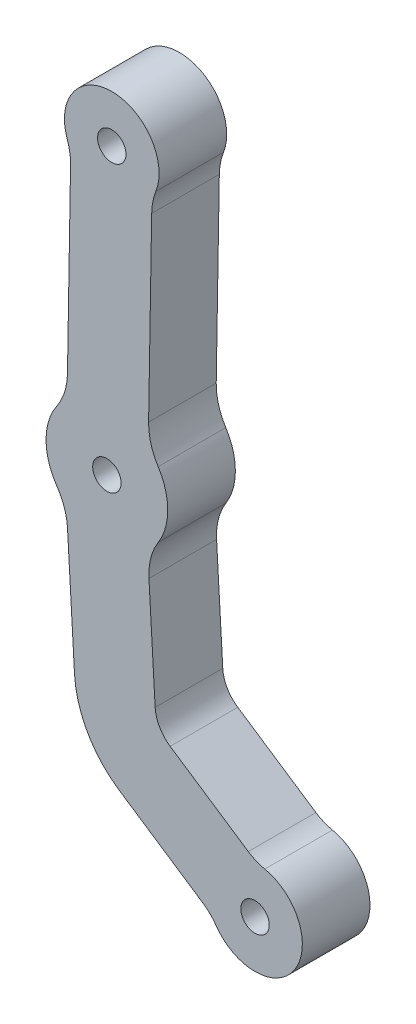
ISO-10303-21;
HEADER;
FILE_DESCRIPTION(('STEP AP214'),'2;1');
FILE_NAME('part.step','',(''),(''),'','','');
FILE_SCHEMA(('AUTOMOTIVE_DESIGN { 1 0 10303 214 1 1 1 1 }'));
ENDSEC;
DATA;
#1=APPLICATION_CONTEXT('core data for automotive mechanical design processes');
#2=APPLICATION_PROTOCOL_DEFINITION('international standard','automotive_design',2000,#1);
#3=PRODUCT_CONTEXT('',#1,'mechanical');
#4=PRODUCT('Part','Part','',(#3));
#5=PRODUCT_RELATED_PRODUCT_CATEGORY('part','',(#4));
#6=PRODUCT_DEFINITION_FORMATION('','',#4);
#7=PRODUCT_DEFINITION_CONTEXT('part definition',#1,'design');
#8=PRODUCT_DEFINITION('design','',#6,#7);
#9=PRODUCT_DEFINITION_SHAPE('','',#8);
#10=(LENGTH_UNIT() NAMED_UNIT(*) SI_UNIT(.MILLI.,.METRE.));
#11=(NAMED_UNIT(*) PLANE_ANGLE_UNIT() SI_UNIT($,.RADIAN.));
#12=(NAMED_UNIT(*) SI_UNIT($,.STERADIAN.) SOLID_ANGLE_UNIT());
#13=UNCERTAINTY_MEASURE_WITH_UNIT(LENGTH_MEASURE(1.E-05),#10,'distance_accuracy_value','');
#14=(GEOMETRIC_REPRESENTATION_CONTEXT(3) GLOBAL_UNCERTAINTY_ASSIGNED_CONTEXT((#13)) GLOBAL_UNIT_ASSIGNED_CONTEXT((#10,
#11,#12)) REPRESENTATION_CONTEXT('',''));
#15=CARTESIAN_POINT('',(0.,0.,0.));
#16=DIRECTION('',(0.,0.,1.));
#17=DIRECTION('',(1.,0.,0.));
#18=AXIS2_PLACEMENT_3D('',#15,#16,#17);
#19=CARTESIAN_POINT('',(-32.4724510234552,22.1569908736504,10.));
#20=DIRECTION('',(0.,0.,1.));
#21=DIRECTION('',(1.,0.,0.));
#22=AXIS2_PLACEMENT_3D('',#19,#20,#21);
#23=PLANE('',#22);
#24=CARTESIAN_POINT('',(-32.4724510234552,22.1569908736504,10.));
#25=DIRECTION('',(0.,0.,1.));
#26=DIRECTION('',(1.,0.,0.));
#27=AXIS2_PLACEMENT_3D('',#24,#25,#26);
#28=CIRCLE('',#27,2.1);
#29=CARTESIAN_POINT('',(-30.3724510234552,22.1569908736504,10.));
#30=VERTEX_POINT('',#29);
#31=EDGE_CURVE('E394',#30,#30,#28,.T.);
#32=ORIENTED_EDGE('',*,*,#31,.F.);
#33=EDGE_LOOP('',(#32));
#34=FACE_BOUND('',#33,.T.);
#35=CARTESIAN_POINT('',(-32.4724510234552,22.1569908736504,10.));
#36=DIRECTION('',(0.,0.,1.));
#37=DIRECTION('',(1.,0.,0.));
#38=AXIS2_PLACEMENT_3D('',#35,#36,#37);
#39=CIRCLE('',#38,8.99999999999997);
#40=CARTESIAN_POINT('',(-39.8872365006634,27.2580649102609,10.));
#41=VERTEX_POINT('',#40);
#42=CARTESIAN_POINT('',(-39.8776424322034,17.0419991630216,10.));
#43=VERTEX_POINT('',#42);
#44=EDGE_CURVE('E245',#41,#43,#39,.T.);
#45=ORIENTED_EDGE('',*,*,#44,.T.);
#46=CARTESIAN_POINT('',(-47.2828338409513,11.9270074523928,10.));
#47=DIRECTION('',(0.,0.,-1.));
#48=DIRECTION('',(1.,0.,0.));
#49=AXIS2_PLACEMENT_3D('',#46,#47,#48);
#50=CIRCLE('',#49,8.99999999999975);
#51=CARTESIAN_POINT('',(-38.2974632572431,12.4399552795908,10.));
#52=VERTEX_POINT('',#51);
#53=EDGE_CURVE('E133',#43,#52,#50,.T.);
#54=ORIENTED_EDGE('',*,*,#53,.T.);
#55=DIRECTION('',(0.0569942030220163,-0.998374509300936,0.));
#56=VECTOR('',#55,1.);
#57=CARTESIAN_POINT('',(-38.2974632572431,12.4399552795908,10.));
#58=LINE('',#57,#56);
#59=CARTESIAN_POINT('',(-37.2602275516961,-5.72943096754912,10.));
#60=VERTEX_POINT('',#59);
#61=EDGE_CURVE('E296',#52,#60,#58,.T.);
#62=ORIENTED_EDGE('',*,*,#61,.T.);
#63=CARTESIAN_POINT('',(-22.284609912182,-4.87451792221888,10.));
#64=DIRECTION('',(0.,0.,1.));
#65=DIRECTION('',(1.,0.,0.));
#66=AXIS2_PLACEMENT_3D('',#63,#64,#65);
#67=CIRCLE('',#66,15.);
#68=CARTESIAN_POINT('',(-30.6036070284312,-17.3562760908359,10.));
#69=VERTEX_POINT('',#68);
#70=EDGE_CURVE('E315',#60,#69,#67,.T.);
#71=ORIENTED_EDGE('',*,*,#70,.T.);
#72=DIRECTION('',(0.832117211241135,-0.554599807749945,0.));
#73=VECTOR('',#72,1.);
#74=CARTESIAN_POINT('',(-30.6036070284312,-17.3562760908359,10.));
#75=LINE('',#74,#73);
#76=CARTESIAN_POINT('',(-18.2184067096662,-25.6109181327743,10.));
#77=VERTEX_POINT('',#76);
#78=EDGE_CURVE('E312',#69,#77,#75,.T.);
#79=ORIENTED_EDGE('',*,*,#78,.T.);
#80=CARTESIAN_POINT('',(-22.1006053639158,-31.4357386114623,10.));
#81=DIRECTION('',(0.,0.,-1.));
#82=DIRECTION('',(1.,0.,0.));
#83=AXIS2_PLACEMENT_3D('',#80,#81,#82);
#84=CIRCLE('',#83,7.00000000000004);
#85=CARTESIAN_POINT('',(-16.3338026143855,-27.4678694039392,10.));
#86=VERTEX_POINT('',#85);
#87=EDGE_CURVE('E314',#77,#86,#84,.T.);
#88=ORIENTED_EDGE('',*,*,#87,.T.);
#89=CARTESIAN_POINT('',(-10.567,-23.5,10.));
#90=DIRECTION('',(0.,0.,1.));
#91=DIRECTION('',(1.,0.,0.));
#92=AXIS2_PLACEMENT_3D('',#89,#90,#91);
#93=CIRCLE('',#92,6.99999999999999);
#94=CARTESIAN_POINT('',(-9.12400518120861,-16.6503455595964,10.));
#95=VERTEX_POINT('',#94);
#96=EDGE_CURVE('E317',#86,#95,#93,.T.);
#97=ORIENTED_EDGE('',*,*,#96,.T.);
#98=CARTESIAN_POINT('',(-7.68101036241734,-9.80069111919286,10.));
#99=DIRECTION('',(0.,0.,-1.));
#100=DIRECTION('',(1.,0.,0.));
#101=AXIS2_PLACEMENT_3D('',#98,#99,#100);
#102=CIRCLE('',#101,6.99999999999984);
#103=CARTESIAN_POINT('',(-11.5632090166668,-15.6255115978807,10.));
#104=VERTEX_POINT('',#103);
#105=EDGE_CURVE('E323',#95,#104,#102,.T.);
#106=ORIENTED_EDGE('',*,*,#105,.T.);
#107=DIRECTION('',(-0.832117211241137,0.554599807749942,0.));
#108=VECTOR('',#107,1.);
#109=CARTESIAN_POINT('',(-11.5632090166668,-15.6255115978807,10.));
#110=LINE('',#109,#108);
#111=CARTESIAN_POINT('',(-23.1177540066393,-7.92449503013205,10.));
#112=VERTEX_POINT('',#111);
#113=EDGE_CURVE('E325',#104,#112,#110,.T.);
#114=ORIENTED_EDGE('',*,*,#113,.T.);
#115=CARTESIAN_POINT('',(-20.3447549678896,-3.76390897392634,10.));
#116=DIRECTION('',(0.,0.,-1.));
#117=DIRECTION('',(1.,0.,0.));
#118=AXIS2_PLACEMENT_3D('',#115,#116,#117);
#119=CIRCLE('',#118,5.00000000000002);
#120=CARTESIAN_POINT('',(-25.3366275143943,-4.04887998903642,10.));
#121=VERTEX_POINT('',#120);
#122=EDGE_CURVE('E327',#112,#121,#119,.T.);
#123=ORIENTED_EDGE('',*,*,#122,.T.);
#124=DIRECTION('',(-0.0569942030220172,0.998374509300936,0.));
#125=VECTOR('',#124,1.);
#126=CARTESIAN_POINT('',(-25.3366275143943,-4.04887998903642,10.));
#127=LINE('',#126,#125);
#128=CARTESIAN_POINT('',(-26.2533530518468,12.0095147263743,10.));
#129=VERTEX_POINT('',#128);
#130=EDGE_CURVE('E329',#121,#129,#127,.T.);
#131=ORIENTED_EDGE('',*,*,#130,.T.);
#132=CARTESIAN_POINT('',(-17.2679824681385,12.5224625535725,10.));
#133=DIRECTION('',(0.,0.,-1.));
#134=DIRECTION('',(1.,0.,0.));
#135=AXIS2_PLACEMENT_3D('',#132,#133,#134);
#136=CIRCLE('',#135,8.99999999999991);
#137=CARTESIAN_POINT('',(-24.8702167457968,17.3397267136115,10.));
#138=VERTEX_POINT('',#137);
#139=EDGE_CURVE('E331',#129,#138,#136,.T.);
#140=ORIENTED_EDGE('',*,*,#139,.T.);
#141=CARTESIAN_POINT('',(-32.4724510234551,22.1569908736504,10.));
#142=DIRECTION('',(0.,0.,1.));
#143=DIRECTION('',(1.,0.,0.));
#144=AXIS2_PLACEMENT_3D('',#141,#142,#143);
#145=CIRCLE('',#144,8.99999999999995);
#146=CARTESIAN_POINT('',(-24.8893819672788,27.0043678642775,10.));
#147=VERTEX_POINT('',#146);
#148=EDGE_CURVE('E333',#138,#147,#145,.T.);
#149=ORIENTED_EDGE('',*,*,#148,.T.);
#150=CARTESIAN_POINT('',(-17.3063130927039,31.8517451389957,10.));
#151=DIRECTION('',(0.,0.,-1.));
#152=DIRECTION('',(1.,0.,0.));
#153=AXIS2_PLACEMENT_3D('',#150,#151,#152);
#154=CIRCLE('',#153,9.00000000000008);
#155=CARTESIAN_POINT('',(-26.3050257582543,32.0039632813584,10.));
#156=VERTEX_POINT('',#155);
#157=EDGE_CURVE('E335',#147,#156,#154,.T.);
#158=ORIENTED_EDGE('',*,*,#157,.T.);
#159=DIRECTION('',(0.0169131269291902,0.999856962838924,0.));
#160=VECTOR('',#159,1.);
#161=CARTESIAN_POINT('',(-26.3050257582543,32.0039632813584,10.));
#162=LINE('',#161,#160);
#163=CARTESIAN_POINT('',(-25.84900791985,58.9624679278507,10.));
#164=VERTEX_POINT('',#163);
#165=EDGE_CURVE('E337',#156,#164,#162,.T.);
#166=ORIENTED_EDGE('',*,*,#165,.T.);
#167=CARTESIAN_POINT('',(-16.8502952542995,58.810249785488,10.));
#168=DIRECTION('',(0.,0.,-1.));
#169=DIRECTION('',(1.,0.,0.));
#170=AXIS2_PLACEMENT_3D('',#167,#168,#169);
#171=CIRCLE('',#170,9.00000000000021);
#172=CARTESIAN_POINT('',(-25.233618645146,62.0843739316513,10.));
#173=VERTEX_POINT('',#172);
#174=EDGE_CURVE('E339',#164,#173,#171,.T.);
#175=ORIENTED_EDGE('',*,*,#174,.T.);
#176=CARTESIAN_POINT('',(-31.7539813915032,64.6309146550479,10.));
#177=DIRECTION('',(0.,0.,1.));
#178=DIRECTION('',(1.,0.,0.));
#179=AXIS2_PLACEMENT_3D('',#176,#177,#178);
#180=CIRCLE('',#179,6.99999999999997);
#181=CARTESIAN_POINT('',(-38.3567414277141,62.3063588040915,10.));
#182=VERTEX_POINT('',#181);
#183=EDGE_CURVE('E188',#173,#182,#180,.T.);
#184=ORIENTED_EDGE('',*,*,#183,.T.);
#185=CARTESIAN_POINT('',(-46.8460041394674,59.3176435933638,10.));
#186=DIRECTION('',(0.,0.,-1.));
#187=DIRECTION('',(1.,0.,0.));
#188=AXIS2_PLACEMENT_3D('',#185,#186,#187);
#189=CIRCLE('',#188,8.99999999999999);
#190=CARTESIAN_POINT('',(-37.8472914739171,59.165425451001,10.));
#191=VERTEX_POINT('',#190);
#192=EDGE_CURVE('E182',#182,#191,#189,.T.);
#193=ORIENTED_EDGE('',*,*,#192,.T.);
#194=DIRECTION('',(-0.0169131269291894,-0.999856962838924,0.));
#195=VECTOR('',#194,1.);
#196=CARTESIAN_POINT('',(-37.8472914739171,59.165425451001,10.));
#197=LINE('',#196,#195);
#198=CARTESIAN_POINT('',(-38.3033093123214,32.2069208045087,10.));
#199=VERTEX_POINT('',#198);
#200=EDGE_CURVE('E186',#191,#199,#197,.T.);
#201=ORIENTED_EDGE('',*,*,#200,.T.);
#202=CARTESIAN_POINT('',(-47.3020219778717,32.3591389468714,10.));
#203=DIRECTION('',(0.,0.,-1.));
#204=DIRECTION('',(1.,0.,0.));
#205=AXIS2_PLACEMENT_3D('',#202,#203,#204);
#206=CIRCLE('',#205,9.00000000000001);
#207=EDGE_CURVE('E54',#199,#41,#206,.T.);
#208=ORIENTED_EDGE('',*,*,#207,.T.);
#209=EDGE_LOOP('',(#45,#54,#62,#71,#79,#88,#97,#106,#114,#123,#131,#140,#149,#158,#166,#175,
#184,#193,#201,#208));
#210=FACE_BOUND('',#209,.T.);
#211=CARTESIAN_POINT('',(-10.567,-23.5,10.));
#212=DIRECTION('',(0.,0.,1.));
#213=DIRECTION('',(1.,0.,0.));
#214=AXIS2_PLACEMENT_3D('',#211,#212,#213);
#215=CIRCLE('',#214,2.1);
#216=CARTESIAN_POINT('',(-8.467,-23.5,10.));
#217=VERTEX_POINT('',#216);
#218=EDGE_CURVE('E210',#217,#217,#215,.T.);
#219=ORIENTED_EDGE('',*,*,#218,.F.);
#220=EDGE_LOOP('',(#219));
#221=FACE_BOUND('',#220,.T.);
#222=CARTESIAN_POINT('',(-31.7539813915032,64.6309146550479,10.));
#223=DIRECTION('',(0.,0.,1.));
#224=DIRECTION('',(1.,0.,0.));
#225=AXIS2_PLACEMENT_3D('',#222,#223,#224);
#226=CIRCLE('',#225,2.1);
#227=CARTESIAN_POINT('',(-29.6539813915032,64.6309146550479,10.));
#228=VERTEX_POINT('',#227);
#229=EDGE_CURVE('E385',#228,#228,#226,.T.);
#230=ORIENTED_EDGE('',*,*,#229,.F.);
#231=EDGE_LOOP('',(#230));
#232=FACE_BOUND('',#231,.T.);
#233=ADVANCED_FACE('F37',(#34,#210,#221,#232),#23,.T.);
#234=CARTESIAN_POINT('',(-32.4724510234552,22.1569908736504,0.));
#235=DIRECTION('',(0.,0.,1.));
#236=DIRECTION('',(1.,0.,0.));
#237=AXIS2_PLACEMENT_3D('',#234,#235,#236);
#238=PLANE('',#237);
#239=CARTESIAN_POINT('',(-32.4724510234552,22.1569908736504,0.));
#240=DIRECTION('',(0.,0.,1.));
#241=DIRECTION('',(1.,0.,0.));
#242=AXIS2_PLACEMENT_3D('',#239,#240,#241);
#243=CIRCLE('',#242,8.99999999999997);
#244=CARTESIAN_POINT('',(-39.8872365006634,27.2580649102609,0.));
#245=VERTEX_POINT('',#244);
#246=CARTESIAN_POINT('',(-39.8776424322034,17.0419991630216,0.));
#247=VERTEX_POINT('',#246);
#248=EDGE_CURVE('E206',#245,#247,#243,.T.);
#249=ORIENTED_EDGE('',*,*,#248,.F.);
#250=CARTESIAN_POINT('',(-47.3020219778717,32.3591389468714,0.));
#251=DIRECTION('',(0.,0.,-1.));
#252=DIRECTION('',(1.,0.,0.));
#253=AXIS2_PLACEMENT_3D('',#250,#251,#252);
#254=CIRCLE('',#253,9.00000000000001);
#255=CARTESIAN_POINT('',(-38.3033093123214,32.2069208045087,0.));
#256=VERTEX_POINT('',#255);
#257=EDGE_CURVE('E125',#256,#245,#254,.T.);
#258=ORIENTED_EDGE('',*,*,#257,.F.);
#259=DIRECTION('',(-0.0169131269291894,-0.999856962838924,0.));
#260=VECTOR('',#259,1.);
#261=CARTESIAN_POINT('',(-37.8472914739171,59.165425451001,0.));
#262=LINE('',#261,#260);
#263=CARTESIAN_POINT('',(-37.8472914739171,59.165425451001,0.));
#264=VERTEX_POINT('',#263);
#265=EDGE_CURVE('E119',#264,#256,#262,.T.);
#266=ORIENTED_EDGE('',*,*,#265,.F.);
#267=CARTESIAN_POINT('',(-46.8460041394674,59.3176435933638,0.));
#268=DIRECTION('',(0.,0.,-1.));
#269=DIRECTION('',(1.,0.,0.));
#270=AXIS2_PLACEMENT_3D('',#267,#268,#269);
#271=CIRCLE('',#270,8.99999999999999);
#272=CARTESIAN_POINT('',(-38.3567414277141,62.3063588040915,0.));
#273=VERTEX_POINT('',#272);
#274=EDGE_CURVE('E196',#273,#264,#271,.T.);
#275=ORIENTED_EDGE('',*,*,#274,.F.);
#276=CARTESIAN_POINT('',(-31.7539813915032,64.6309146550479,0.));
#277=DIRECTION('',(0.,0.,1.));
#278=DIRECTION('',(1.,0.,0.));
#279=AXIS2_PLACEMENT_3D('',#276,#277,#278);
#280=CIRCLE('',#279,6.99999999999997);
#281=CARTESIAN_POINT('',(-25.233618645146,62.0843739316513,0.));
#282=VERTEX_POINT('',#281);
#283=EDGE_CURVE('E240',#282,#273,#280,.T.);
#284=ORIENTED_EDGE('',*,*,#283,.F.);
#285=CARTESIAN_POINT('',(-16.8502952542995,58.810249785488,0.));
#286=DIRECTION('',(0.,0.,-1.));
#287=DIRECTION('',(1.,0.,0.));
#288=AXIS2_PLACEMENT_3D('',#285,#286,#287);
#289=CIRCLE('',#288,9.00000000000021);
#290=CARTESIAN_POINT('',(-25.84900791985,58.9624679278507,0.));
#291=VERTEX_POINT('',#290);
#292=EDGE_CURVE('E238',#291,#282,#289,.T.);
#293=ORIENTED_EDGE('',*,*,#292,.F.);
#294=DIRECTION('',(0.0169131269291902,0.999856962838924,0.));
#295=VECTOR('',#294,1.);
#296=CARTESIAN_POINT('',(-26.3050257582543,32.0039632813584,0.));
#297=LINE('',#296,#295);
#298=CARTESIAN_POINT('',(-26.3050257582543,32.0039632813584,0.));
#299=VERTEX_POINT('',#298);
#300=EDGE_CURVE('E236',#299,#291,#297,.T.);
#301=ORIENTED_EDGE('',*,*,#300,.F.);
#302=CARTESIAN_POINT('',(-17.3063130927039,31.8517451389957,0.));
#303=DIRECTION('',(0.,0.,-1.));
#304=DIRECTION('',(1.,0.,0.));
#305=AXIS2_PLACEMENT_3D('',#302,#303,#304);
#306=CIRCLE('',#305,9.00000000000008);
#307=CARTESIAN_POINT('',(-24.8893819672788,27.0043678642775,0.));
#308=VERTEX_POINT('',#307);
#309=EDGE_CURVE('E234',#308,#299,#306,.T.);
#310=ORIENTED_EDGE('',*,*,#309,.F.);
#311=CARTESIAN_POINT('',(-32.4724510234551,22.1569908736504,0.));
#312=DIRECTION('',(0.,0.,1.));
#313=DIRECTION('',(1.,0.,0.));
#314=AXIS2_PLACEMENT_3D('',#311,#312,#313);
#315=CIRCLE('',#314,8.99999999999995);
#316=CARTESIAN_POINT('',(-24.8702167457968,17.3397267136115,0.));
#317=VERTEX_POINT('',#316);
#318=EDGE_CURVE('E232',#317,#308,#315,.T.);
#319=ORIENTED_EDGE('',*,*,#318,.F.);
#320=CARTESIAN_POINT('',(-17.2679824681385,12.5224625535725,0.));
#321=DIRECTION('',(0.,0.,-1.));
#322=DIRECTION('',(1.,0.,0.));
#323=AXIS2_PLACEMENT_3D('',#320,#321,#322);
#324=CIRCLE('',#323,8.99999999999991);
#325=CARTESIAN_POINT('',(-26.2533530518468,12.0095147263743,0.));
#326=VERTEX_POINT('',#325);
#327=EDGE_CURVE('E230',#326,#317,#324,.T.);
#328=ORIENTED_EDGE('',*,*,#327,.F.);
#329=DIRECTION('',(-0.0569942030220172,0.998374509300936,0.));
#330=VECTOR('',#329,1.);
#331=CARTESIAN_POINT('',(-25.3366275143943,-4.04887998903642,0.));
#332=LINE('',#331,#330);
#333=CARTESIAN_POINT('',(-25.3366275143943,-4.04887998903642,0.));
#334=VERTEX_POINT('',#333);
#335=EDGE_CURVE('E228',#334,#326,#332,.T.);
#336=ORIENTED_EDGE('',*,*,#335,.F.);
#337=CARTESIAN_POINT('',(-20.3447549678896,-3.76390897392634,0.));
#338=DIRECTION('',(0.,0.,-1.));
#339=DIRECTION('',(1.,0.,0.));
#340=AXIS2_PLACEMENT_3D('',#337,#338,#339);
#341=CIRCLE('',#340,5.00000000000002);
#342=CARTESIAN_POINT('',(-23.1177540066393,-7.92449503013205,0.));
#343=VERTEX_POINT('',#342);
#344=EDGE_CURVE('E226',#343,#334,#341,.T.);
#345=ORIENTED_EDGE('',*,*,#344,.F.);
#346=DIRECTION('',(-0.832117211241137,0.554599807749942,0.));
#347=VECTOR('',#346,1.);
#348=CARTESIAN_POINT('',(-11.5632090166668,-15.6255115978807,0.));
#349=LINE('',#348,#347);
#350=CARTESIAN_POINT('',(-11.5632090166668,-15.6255115978807,0.));
#351=VERTEX_POINT('',#350);
#352=EDGE_CURVE('E224',#351,#343,#349,.T.);
#353=ORIENTED_EDGE('',*,*,#352,.F.);
#354=CARTESIAN_POINT('',(-7.68101036241734,-9.80069111919286,0.));
#355=DIRECTION('',(0.,0.,-1.));
#356=DIRECTION('',(1.,0.,0.));
#357=AXIS2_PLACEMENT_3D('',#354,#355,#356);
#358=CIRCLE('',#357,6.99999999999984);
#359=CARTESIAN_POINT('',(-9.12400518120861,-16.6503455595964,0.));
#360=VERTEX_POINT('',#359);
#361=EDGE_CURVE('E222',#360,#351,#358,.T.);
#362=ORIENTED_EDGE('',*,*,#361,.F.);
#363=CARTESIAN_POINT('',(-10.567,-23.5,0.));
#364=DIRECTION('',(0.,0.,1.));
#365=DIRECTION('',(1.,0.,0.));
#366=AXIS2_PLACEMENT_3D('',#363,#364,#365);
#367=CIRCLE('',#366,6.99999999999999);
#368=CARTESIAN_POINT('',(-16.3338026143855,-27.4678694039392,0.));
#369=VERTEX_POINT('',#368);
#370=EDGE_CURVE('E220',#369,#360,#367,.T.);
#371=ORIENTED_EDGE('',*,*,#370,.F.);
#372=CARTESIAN_POINT('',(-22.1006053639158,-31.4357386114623,0.));
#373=DIRECTION('',(0.,0.,-1.));
#374=DIRECTION('',(1.,0.,0.));
#375=AXIS2_PLACEMENT_3D('',#372,#373,#374);
#376=CIRCLE('',#375,7.00000000000004);
#377=CARTESIAN_POINT('',(-18.2184067096662,-25.6109181327743,0.));
#378=VERTEX_POINT('',#377);
#379=EDGE_CURVE('E218',#378,#369,#376,.T.);
#380=ORIENTED_EDGE('',*,*,#379,.F.);
#381=DIRECTION('',(0.832117211241135,-0.554599807749945,0.));
#382=VECTOR('',#381,1.);
#383=CARTESIAN_POINT('',(-30.6036070284312,-17.3562760908359,0.));
#384=LINE('',#383,#382);
#385=CARTESIAN_POINT('',(-30.6036070284312,-17.3562760908359,0.));
#386=VERTEX_POINT('',#385);
#387=EDGE_CURVE('E216',#386,#378,#384,.T.);
#388=ORIENTED_EDGE('',*,*,#387,.F.);
#389=CARTESIAN_POINT('',(-22.284609912182,-4.87451792221888,0.));
#390=DIRECTION('',(0.,0.,1.));
#391=DIRECTION('',(1.,0.,0.));
#392=AXIS2_PLACEMENT_3D('',#389,#390,#391);
#393=CIRCLE('',#392,15.);
#394=CARTESIAN_POINT('',(-37.2602275516961,-5.72943096754912,0.));
#395=VERTEX_POINT('',#394);
#396=EDGE_CURVE('E214',#395,#386,#393,.T.);
#397=ORIENTED_EDGE('',*,*,#396,.F.);
#398=DIRECTION('',(0.0569942030220163,-0.998374509300936,0.));
#399=VECTOR('',#398,1.);
#400=CARTESIAN_POINT('',(-38.2974632572431,12.4399552795908,0.));
#401=LINE('',#400,#399);
#402=CARTESIAN_POINT('',(-38.2974632572431,12.4399552795908,0.));
#403=VERTEX_POINT('',#402);
#404=EDGE_CURVE('E212',#403,#395,#401,.T.);
#405=ORIENTED_EDGE('',*,*,#404,.F.);
#406=CARTESIAN_POINT('',(-47.2828338409513,11.9270074523928,0.));
#407=DIRECTION('',(0.,0.,-1.));
#408=DIRECTION('',(1.,0.,0.));
#409=AXIS2_PLACEMENT_3D('',#406,#407,#408);
#410=CIRCLE('',#409,8.99999999999975);
#411=EDGE_CURVE('E209',#247,#403,#410,.T.);
#412=ORIENTED_EDGE('',*,*,#411,.F.);
#413=EDGE_LOOP('',(#249,#258,#266,#275,#284,#293,#301,#310,#319,#328,#336,#345,#353,#362,#371,
#380,#388,#397,#405,#412));
#414=FACE_BOUND('',#413,.T.);
#415=CARTESIAN_POINT('',(-10.567,-23.5,0.));
#416=DIRECTION('',(0.,0.,1.));
#417=DIRECTION('',(1.,0.,0.));
#418=AXIS2_PLACEMENT_3D('',#415,#416,#417);
#419=CIRCLE('',#418,2.1);
#420=CARTESIAN_POINT('',(-8.467,-23.5,0.));
#421=VERTEX_POINT('',#420);
#422=EDGE_CURVE('E397',#421,#421,#419,.T.);
#423=ORIENTED_EDGE('',*,*,#422,.T.);
#424=EDGE_LOOP('',(#423));
#425=FACE_BOUND('',#424,.T.);
#426=CARTESIAN_POINT('',(-32.4724510234552,22.1569908736504,0.));
#427=DIRECTION('',(0.,0.,1.));
#428=DIRECTION('',(1.,0.,0.));
#429=AXIS2_PLACEMENT_3D('',#426,#427,#428);
#430=CIRCLE('',#429,2.1);
#431=CARTESIAN_POINT('',(-30.3724510234552,22.1569908736504,0.));
#432=VERTEX_POINT('',#431);
#433=EDGE_CURVE('E391',#432,#432,#430,.T.);
#434=ORIENTED_EDGE('',*,*,#433,.T.);
#435=EDGE_LOOP('',(#434));
#436=FACE_BOUND('',#435,.T.);
#437=CARTESIAN_POINT('',(-31.7539813915032,64.6309146550479,0.));
#438=DIRECTION('',(0.,0.,1.));
#439=DIRECTION('',(1.,0.,0.));
#440=AXIS2_PLACEMENT_3D('',#437,#438,#439);
#441=CIRCLE('',#440,2.1);
#442=CARTESIAN_POINT('',(-29.6539813915032,64.6309146550479,0.));
#443=VERTEX_POINT('',#442);
#444=EDGE_CURVE('E388',#443,#443,#441,.T.);
#445=ORIENTED_EDGE('',*,*,#444,.T.);
#446=EDGE_LOOP('',(#445));
#447=FACE_BOUND('',#446,.T.);
#448=ADVANCED_FACE('F300',(#414,#425,#436,#447),#238,.F.);
#449=CARTESIAN_POINT('',(-32.4724510234552,22.1569908736504,10.));
#450=DIRECTION('',(0.,0.,-1.));
#451=DIRECTION('',(-1.,0.,0.));
#452=AXIS2_PLACEMENT_3D('',#449,#450,#451);
#453=CYLINDRICAL_SURFACE('',#452,8.99999999999997);
#454=ORIENTED_EDGE('',*,*,#248,.T.);
#455=DIRECTION('',(0.,0.,-1.));
#456=VECTOR('',#455,1.);
#457=CARTESIAN_POINT('',(-39.8776424322034,17.0419991630216,10.));
#458=LINE('',#457,#456);
#459=EDGE_CURVE('E11',#43,#247,#458,.T.);
#460=ORIENTED_EDGE('',*,*,#459,.F.);
#461=ORIENTED_EDGE('',*,*,#44,.F.);
#462=DIRECTION('',(0.,0.,-1.));
#463=VECTOR('',#462,1.);
#464=CARTESIAN_POINT('',(-39.8872365006634,27.2580649102609,10.));
#465=LINE('',#464,#463);
#466=EDGE_CURVE('E202',#41,#245,#465,.T.);
#467=ORIENTED_EDGE('',*,*,#466,.T.);
#468=EDGE_LOOP('',(#454,#460,#461,#467));
#469=FACE_BOUND('',#468,.T.);
#470=ADVANCED_FACE('F39',(#469),#453,.T.);
#471=CARTESIAN_POINT('',(-47.2828338409513,11.9270074523928,10.));
#472=DIRECTION('',(0.,0.,-1.));
#473=DIRECTION('',(-1.,0.,0.));
#474=AXIS2_PLACEMENT_3D('',#471,#472,#473);
#475=CYLINDRICAL_SURFACE('',#474,8.99999999999975);
#476=ORIENTED_EDGE('',*,*,#411,.T.);
#477=DIRECTION('',(0.,0.,-1.));
#478=VECTOR('',#477,1.);
#479=CARTESIAN_POINT('',(-38.2974632572431,12.4399552795908,10.));
#480=LINE('',#479,#478);
#481=EDGE_CURVE('E46',#52,#403,#480,.T.);
#482=ORIENTED_EDGE('',*,*,#481,.F.);
#483=ORIENTED_EDGE('',*,*,#53,.F.);
#484=ORIENTED_EDGE('',*,*,#459,.T.);
#485=EDGE_LOOP('',(#476,#482,#483,#484));
#486=FACE_BOUND('',#485,.T.);
#487=ADVANCED_FACE('F597',(#486),#475,.F.);
#488=CARTESIAN_POINT('',(-38.2974632572431,12.4399552795908,10.));
#489=DIRECTION('',(0.998374509300936,0.0569942030220163,0.));
#490=DIRECTION('',(-0.0569942030220163,0.998374509300936,0.));
#491=AXIS2_PLACEMENT_3D('',#488,#489,#490);
#492=PLANE('',#491);
#493=ORIENTED_EDGE('',*,*,#404,.T.);
#494=DIRECTION('',(0.,0.,-1.));
#495=VECTOR('',#494,1.);
#496=CARTESIAN_POINT('',(-37.2602275516961,-5.72943096754912,10.));
#497=LINE('',#496,#495);
#498=EDGE_CURVE('E288',#60,#395,#497,.T.);
#499=ORIENTED_EDGE('',*,*,#498,.F.);
#500=ORIENTED_EDGE('',*,*,#61,.F.);
#501=ORIENTED_EDGE('',*,*,#481,.T.);
#502=EDGE_LOOP('',(#493,#499,#500,#501));
#503=FACE_BOUND('',#502,.T.);
#504=ADVANCED_FACE('F294',(#503),#492,.F.);
#505=CARTESIAN_POINT('',(-22.284609912182,-4.87451792221888,10.));
#506=DIRECTION('',(0.,0.,-1.));
#507=DIRECTION('',(-1.,0.,0.));
#508=AXIS2_PLACEMENT_3D('',#505,#506,#507);
#509=CYLINDRICAL_SURFACE('',#508,15.);
#510=ORIENTED_EDGE('',*,*,#396,.T.);
#511=DIRECTION('',(0.,0.,-1.));
#512=VECTOR('',#511,1.);
#513=CARTESIAN_POINT('',(-30.6036070284312,-17.3562760908359,10.));
#514=LINE('',#513,#512);
#515=EDGE_CURVE('E285',#69,#386,#514,.T.);
#516=ORIENTED_EDGE('',*,*,#515,.F.);
#517=ORIENTED_EDGE('',*,*,#70,.F.);
#518=ORIENTED_EDGE('',*,*,#498,.T.);
#519=EDGE_LOOP('',(#510,#516,#517,#518));
#520=FACE_BOUND('',#519,.T.);
#521=ADVANCED_FACE('F306',(#520),#509,.T.);
#522=CARTESIAN_POINT('',(-30.6036070284312,-17.3562760908359,10.));
#523=DIRECTION('',(0.554599807749945,0.832117211241135,0.));
#524=DIRECTION('',(-0.832117211241136,0.554599807749945,0.));
#525=AXIS2_PLACEMENT_3D('',#522,#523,#524);
#526=PLANE('',#525);
#527=ORIENTED_EDGE('',*,*,#387,.T.);
#528=DIRECTION('',(0.,0.,-1.));
#529=VECTOR('',#528,1.);
#530=CARTESIAN_POINT('',(-18.2184067096662,-25.6109181327743,10.));
#531=LINE('',#530,#529);
#532=EDGE_CURVE('E282',#77,#378,#531,.T.);
#533=ORIENTED_EDGE('',*,*,#532,.F.);
#534=ORIENTED_EDGE('',*,*,#78,.F.);
#535=ORIENTED_EDGE('',*,*,#515,.T.);
#536=EDGE_LOOP('',(#527,#533,#534,#535));
#537=FACE_BOUND('',#536,.T.);
#538=ADVANCED_FACE('F310',(#537),#526,.F.);
#539=CARTESIAN_POINT('',(-22.1006053639158,-31.4357386114623,10.));
#540=DIRECTION('',(0.,0.,-1.));
#541=DIRECTION('',(-1.,0.,0.));
#542=AXIS2_PLACEMENT_3D('',#539,#540,#541);
#543=CYLINDRICAL_SURFACE('',#542,7.00000000000004);
#544=ORIENTED_EDGE('',*,*,#379,.T.);
#545=DIRECTION('',(0.,0.,-1.));
#546=VECTOR('',#545,1.);
#547=CARTESIAN_POINT('',(-16.3338026143855,-27.4678694039392,10.));
#548=LINE('',#547,#546);
#549=EDGE_CURVE('E279',#86,#369,#548,.T.);
#550=ORIENTED_EDGE('',*,*,#549,.F.);
#551=ORIENTED_EDGE('',*,*,#87,.F.);
#552=ORIENTED_EDGE('',*,*,#532,.T.);
#553=EDGE_LOOP('',(#544,#550,#551,#552));
#554=FACE_BOUND('',#553,.T.);
#555=ADVANCED_FACE('F558',(#554),#543,.F.);
#556=CARTESIAN_POINT('',(-10.567,-23.5,10.));
#557=DIRECTION('',(0.,0.,-1.));
#558=DIRECTION('',(-1.,0.,0.));
#559=AXIS2_PLACEMENT_3D('',#556,#557,#558);
#560=CYLINDRICAL_SURFACE('',#559,6.99999999999999);
#561=ORIENTED_EDGE('',*,*,#370,.T.);
#562=DIRECTION('',(0.,0.,-1.));
#563=VECTOR('',#562,1.);
#564=CARTESIAN_POINT('',(-9.12400518120861,-16.6503455595964,10.));
#565=LINE('',#564,#563);
#566=EDGE_CURVE('E276',#95,#360,#565,.T.);
#567=ORIENTED_EDGE('',*,*,#566,.F.);
#568=ORIENTED_EDGE('',*,*,#96,.F.);
#569=ORIENTED_EDGE('',*,*,#549,.T.);
#570=EDGE_LOOP('',(#561,#567,#568,#569));
#571=FACE_BOUND('',#570,.T.);
#572=ADVANCED_FACE('F547',(#571),#560,.T.);
#573=CARTESIAN_POINT('',(-7.68101036241734,-9.80069111919286,10.));
#574=DIRECTION('',(0.,0.,-1.));
#575=DIRECTION('',(-1.,0.,0.));
#576=AXIS2_PLACEMENT_3D('',#573,#574,#575);
#577=CYLINDRICAL_SURFACE('',#576,6.99999999999984);
#578=ORIENTED_EDGE('',*,*,#361,.T.);
#579=DIRECTION('',(0.,0.,-1.));
#580=VECTOR('',#579,1.);
#581=CARTESIAN_POINT('',(-11.5632090166668,-15.6255115978807,10.));
#582=LINE('',#581,#580);
#583=EDGE_CURVE('E273',#104,#351,#582,.T.);
#584=ORIENTED_EDGE('',*,*,#583,.F.);
#585=ORIENTED_EDGE('',*,*,#105,.F.);
#586=ORIENTED_EDGE('',*,*,#566,.T.);
#587=EDGE_LOOP('',(#578,#584,#585,#586));
#588=FACE_BOUND('',#587,.T.);
#589=ADVANCED_FACE('F536',(#588),#577,.F.);
#590=CARTESIAN_POINT('',(-11.5632090166668,-15.6255115978807,10.));
#591=DIRECTION('',(-0.554599807749942,-0.832117211241137,0.));
#592=DIRECTION('',(0.832117211241137,-0.554599807749942,0.));
#593=AXIS2_PLACEMENT_3D('',#590,#591,#592);
#594=PLANE('',#593);
#595=ORIENTED_EDGE('',*,*,#352,.T.);
#596=DIRECTION('',(0.,0.,-1.));
#597=VECTOR('',#596,1.);
#598=CARTESIAN_POINT('',(-23.1177540066393,-7.92449503013205,10.));
#599=LINE('',#598,#597);
#600=EDGE_CURVE('E270',#112,#343,#599,.T.);
#601=ORIENTED_EDGE('',*,*,#600,.F.);
#602=ORIENTED_EDGE('',*,*,#113,.F.);
#603=ORIENTED_EDGE('',*,*,#583,.T.);
#604=EDGE_LOOP('',(#595,#601,#602,#603));
#605=FACE_BOUND('',#604,.T.);
#606=ADVANCED_FACE('F525',(#605),#594,.F.);
#607=CARTESIAN_POINT('',(-20.3447549678896,-3.76390897392634,10.));
#608=DIRECTION('',(0.,0.,-1.));
#609=DIRECTION('',(-1.,0.,0.));
#610=AXIS2_PLACEMENT_3D('',#607,#608,#609);
#611=CYLINDRICAL_SURFACE('',#610,5.00000000000002);
#612=ORIENTED_EDGE('',*,*,#344,.T.);
#613=DIRECTION('',(0.,0.,-1.));
#614=VECTOR('',#613,1.);
#615=CARTESIAN_POINT('',(-25.3366275143943,-4.04887998903642,10.));
#616=LINE('',#615,#614);
#617=EDGE_CURVE('E267',#121,#334,#616,.T.);
#618=ORIENTED_EDGE('',*,*,#617,.F.);
#619=ORIENTED_EDGE('',*,*,#122,.F.);
#620=ORIENTED_EDGE('',*,*,#600,.T.);
#621=EDGE_LOOP('',(#612,#618,#619,#620));
#622=FACE_BOUND('',#621,.T.);
#623=ADVANCED_FACE('F514',(#622),#611,.F.);
#624=CARTESIAN_POINT('',(-25.3366275143943,-4.04887998903642,10.));
#625=DIRECTION('',(-0.998374509300936,-0.0569942030220172,0.));
#626=DIRECTION('',(0.0569942030220172,-0.998374509300936,0.));
#627=AXIS2_PLACEMENT_3D('',#624,#625,#626);
#628=PLANE('',#627);
#629=ORIENTED_EDGE('',*,*,#335,.T.);
#630=DIRECTION('',(0.,0.,-1.));
#631=VECTOR('',#630,1.);
#632=CARTESIAN_POINT('',(-26.2533530518468,12.0095147263743,10.));
#633=LINE('',#632,#631);
#634=EDGE_CURVE('E264',#129,#326,#633,.T.);
#635=ORIENTED_EDGE('',*,*,#634,.F.);
#636=ORIENTED_EDGE('',*,*,#130,.F.);
#637=ORIENTED_EDGE('',*,*,#617,.T.);
#638=EDGE_LOOP('',(#629,#635,#636,#637));
#639=FACE_BOUND('',#638,.T.);
#640=ADVANCED_FACE('F503',(#639),#628,.F.);
#641=CARTESIAN_POINT('',(-17.2679824681385,12.5224625535725,10.));
#642=DIRECTION('',(0.,0.,-1.));
#643=DIRECTION('',(-1.,0.,0.));
#644=AXIS2_PLACEMENT_3D('',#641,#642,#643);
#645=CYLINDRICAL_SURFACE('',#644,8.99999999999991);
#646=ORIENTED_EDGE('',*,*,#327,.T.);
#647=DIRECTION('',(0.,0.,-1.));
#648=VECTOR('',#647,1.);
#649=CARTESIAN_POINT('',(-24.8702167457968,17.3397267136115,10.));
#650=LINE('',#649,#648);
#651=EDGE_CURVE('E261',#138,#317,#650,.T.);
#652=ORIENTED_EDGE('',*,*,#651,.F.);
#653=ORIENTED_EDGE('',*,*,#139,.F.);
#654=ORIENTED_EDGE('',*,*,#634,.T.);
#655=EDGE_LOOP('',(#646,#652,#653,#654));
#656=FACE_BOUND('',#655,.T.);
#657=ADVANCED_FACE('F492',(#656),#645,.F.);
#658=CARTESIAN_POINT('',(-32.4724510234551,22.1569908736504,10.));
#659=DIRECTION('',(0.,0.,-1.));
#660=DIRECTION('',(-1.,0.,0.));
#661=AXIS2_PLACEMENT_3D('',#658,#659,#660);
#662=CYLINDRICAL_SURFACE('',#661,8.99999999999995);
#663=ORIENTED_EDGE('',*,*,#318,.T.);
#664=DIRECTION('',(0.,0.,-1.));
#665=VECTOR('',#664,1.);
#666=CARTESIAN_POINT('',(-24.8893819672788,27.0043678642775,10.));
#667=LINE('',#666,#665);
#668=EDGE_CURVE('E258',#147,#308,#667,.T.);
#669=ORIENTED_EDGE('',*,*,#668,.F.);
#670=ORIENTED_EDGE('',*,*,#148,.F.);
#671=ORIENTED_EDGE('',*,*,#651,.T.);
#672=EDGE_LOOP('',(#663,#669,#670,#671));
#673=FACE_BOUND('',#672,.T.);
#674=ADVANCED_FACE('F481',(#673),#662,.T.);
#675=CARTESIAN_POINT('',(-17.3063130927039,31.8517451389957,10.));
#676=DIRECTION('',(0.,0.,-1.));
#677=DIRECTION('',(-1.,0.,0.));
#678=AXIS2_PLACEMENT_3D('',#675,#676,#677);
#679=CYLINDRICAL_SURFACE('',#678,9.00000000000008);
#680=ORIENTED_EDGE('',*,*,#309,.T.);
#681=DIRECTION('',(0.,0.,-1.));
#682=VECTOR('',#681,1.);
#683=CARTESIAN_POINT('',(-26.3050257582543,32.0039632813584,10.));
#684=LINE('',#683,#682);
#685=EDGE_CURVE('E255',#156,#299,#684,.T.);
#686=ORIENTED_EDGE('',*,*,#685,.F.);
#687=ORIENTED_EDGE('',*,*,#157,.F.);
#688=ORIENTED_EDGE('',*,*,#668,.T.);
#689=EDGE_LOOP('',(#680,#686,#687,#688));
#690=FACE_BOUND('',#689,.T.);
#691=ADVANCED_FACE('F470',(#690),#679,.F.);
#692=CARTESIAN_POINT('',(-26.3050257582543,32.0039632813584,10.));
#693=DIRECTION('',(-0.999856962838924,0.0169131269291902,0.));
#694=DIRECTION('',(-0.0169131269291902,-0.999856962838924,0.));
#695=AXIS2_PLACEMENT_3D('',#692,#693,#694);
#696=PLANE('',#695);
#697=ORIENTED_EDGE('',*,*,#300,.T.);
#698=DIRECTION('',(0.,0.,-1.));
#699=VECTOR('',#698,1.);
#700=CARTESIAN_POINT('',(-25.84900791985,58.9624679278507,10.));
#701=LINE('',#700,#699);
#702=EDGE_CURVE('E252',#164,#291,#701,.T.);
#703=ORIENTED_EDGE('',*,*,#702,.F.);
#704=ORIENTED_EDGE('',*,*,#165,.F.);
#705=ORIENTED_EDGE('',*,*,#685,.T.);
#706=EDGE_LOOP('',(#697,#703,#704,#705));
#707=FACE_BOUND('',#706,.T.);
#708=ADVANCED_FACE('F460',(#707),#696,.F.);
#709=CARTESIAN_POINT('',(-16.8502952542995,58.810249785488,10.));
#710=DIRECTION('',(0.,0.,-1.));
#711=DIRECTION('',(-1.,0.,0.));
#712=AXIS2_PLACEMENT_3D('',#709,#710,#711);
#713=CYLINDRICAL_SURFACE('',#712,9.00000000000021);
#714=ORIENTED_EDGE('',*,*,#292,.T.);
#715=DIRECTION('',(0.,0.,-1.));
#716=VECTOR('',#715,1.);
#717=CARTESIAN_POINT('',(-25.233618645146,62.0843739316513,10.));
#718=LINE('',#717,#716);
#719=EDGE_CURVE('E249',#173,#282,#718,.T.);
#720=ORIENTED_EDGE('',*,*,#719,.F.);
#721=ORIENTED_EDGE('',*,*,#174,.F.);
#722=ORIENTED_EDGE('',*,*,#702,.T.);
#723=EDGE_LOOP('',(#714,#720,#721,#722));
#724=FACE_BOUND('',#723,.T.);
#725=ADVANCED_FACE('F345',(#724),#713,.F.);
#726=CARTESIAN_POINT('',(-31.7539813915032,64.6309146550479,10.));
#727=DIRECTION('',(0.,0.,-1.));
#728=DIRECTION('',(-1.,0.,0.));
#729=AXIS2_PLACEMENT_3D('',#726,#727,#728);
#730=CYLINDRICAL_SURFACE('',#729,6.99999999999997);
#731=ORIENTED_EDGE('',*,*,#283,.T.);
#732=DIRECTION('',(0.,0.,-1.));
#733=VECTOR('',#732,1.);
#734=CARTESIAN_POINT('',(-38.3567414277141,62.3063588040915,10.));
#735=LINE('',#734,#733);
#736=EDGE_CURVE('E197',#182,#273,#735,.T.);
#737=ORIENTED_EDGE('',*,*,#736,.F.);
#738=ORIENTED_EDGE('',*,*,#183,.F.);
#739=ORIENTED_EDGE('',*,*,#719,.T.);
#740=EDGE_LOOP('',(#731,#737,#738,#739));
#741=FACE_BOUND('',#740,.T.);
#742=ADVANCED_FACE('F349',(#741),#730,.T.);
#743=CARTESIAN_POINT('',(-46.8460041394674,59.3176435933638,10.));
#744=DIRECTION('',(0.,0.,-1.));
#745=DIRECTION('',(-1.,0.,0.));
#746=AXIS2_PLACEMENT_3D('',#743,#744,#745);
#747=CYLINDRICAL_SURFACE('',#746,8.99999999999999);
#748=ORIENTED_EDGE('',*,*,#274,.T.);
#749=DIRECTION('',(0.,0.,-1.));
#750=VECTOR('',#749,1.);
#751=CARTESIAN_POINT('',(-37.8472914739171,59.165425451001,10.));
#752=LINE('',#751,#750);
#753=EDGE_CURVE('E193',#191,#264,#752,.T.);
#754=ORIENTED_EDGE('',*,*,#753,.F.);
#755=ORIENTED_EDGE('',*,*,#192,.F.);
#756=ORIENTED_EDGE('',*,*,#736,.T.);
#757=EDGE_LOOP('',(#748,#754,#755,#756));
#758=FACE_BOUND('',#757,.T.);
#759=ADVANCED_FACE('F194',(#758),#747,.F.);
#760=CARTESIAN_POINT('',(-37.8472914739171,59.165425451001,10.));
#761=DIRECTION('',(0.999856962838924,-0.0169131269291894,0.));
#762=DIRECTION('',(0.0169131269291894,0.999856962838924,0.));
#763=AXIS2_PLACEMENT_3D('',#760,#761,#762);
#764=PLANE('',#763);
#765=ORIENTED_EDGE('',*,*,#265,.T.);
#766=DIRECTION('',(0.,0.,-1.));
#767=VECTOR('',#766,1.);
#768=CARTESIAN_POINT('',(-38.3033093123214,32.2069208045087,10.));
#769=LINE('',#768,#767);
#770=EDGE_CURVE('E198',#199,#256,#769,.T.);
#771=ORIENTED_EDGE('',*,*,#770,.F.);
#772=ORIENTED_EDGE('',*,*,#200,.F.);
#773=ORIENTED_EDGE('',*,*,#753,.T.);
#774=EDGE_LOOP('',(#765,#771,#772,#773));
#775=FACE_BOUND('',#774,.T.);
#776=ADVANCED_FACE('F200',(#775),#764,.F.);
#777=CARTESIAN_POINT('',(-47.3020219778717,32.3591389468714,10.));
#778=DIRECTION('',(0.,0.,-1.));
#779=DIRECTION('',(-1.,0.,0.));
#780=AXIS2_PLACEMENT_3D('',#777,#778,#779);
#781=CYLINDRICAL_SURFACE('',#780,9.00000000000001);
#782=ORIENTED_EDGE('',*,*,#257,.T.);
#783=ORIENTED_EDGE('',*,*,#466,.F.);
#784=ORIENTED_EDGE('',*,*,#207,.F.);
#785=ORIENTED_EDGE('',*,*,#770,.T.);
#786=EDGE_LOOP('',(#782,#783,#784,#785));
#787=FACE_BOUND('',#786,.T.);
#788=ADVANCED_FACE('F353',(#787),#781,.F.);
#789=CARTESIAN_POINT('',(-10.567,-23.5,10.));
#790=DIRECTION('',(0.,0.,-1.));
#791=DIRECTION('',(-1.,0.,0.));
#792=AXIS2_PLACEMENT_3D('',#789,#790,#791);
#793=CYLINDRICAL_SURFACE('',#792,2.1);
#794=ORIENTED_EDGE('',*,*,#218,.T.);
#795=EDGE_LOOP('',(#794));
#796=FACE_BOUND('',#795,.T.);
#797=ORIENTED_EDGE('',*,*,#422,.F.);
#798=EDGE_LOOP('',(#797));
#799=FACE_BOUND('',#798,.T.);
#800=ADVANCED_FACE('F355',(#796,#799),#793,.F.);
#801=CARTESIAN_POINT('',(-32.4724510234552,22.1569908736504,10.));
#802=DIRECTION('',(0.,0.,-1.));
#803=DIRECTION('',(-1.,0.,0.));
#804=AXIS2_PLACEMENT_3D('',#801,#802,#803);
#805=CYLINDRICAL_SURFACE('',#804,2.1);
#806=ORIENTED_EDGE('',*,*,#31,.T.);
#807=EDGE_LOOP('',(#806));
#808=FACE_BOUND('',#807,.T.);
#809=ORIENTED_EDGE('',*,*,#433,.F.);
#810=EDGE_LOOP('',(#809));
#811=FACE_BOUND('',#810,.T.);
#812=ADVANCED_FACE('F361',(#808,#811),#805,.F.);
#813=CARTESIAN_POINT('',(-31.7539813915032,64.6309146550479,10.));
#814=DIRECTION('',(0.,0.,-1.));
#815=DIRECTION('',(-1.,0.,0.));
#816=AXIS2_PLACEMENT_3D('',#813,#814,#815);
#817=CYLINDRICAL_SURFACE('',#816,2.1);
#818=ORIENTED_EDGE('',*,*,#229,.T.);
#819=EDGE_LOOP('',(#818));
#820=FACE_BOUND('',#819,.T.);
#821=ORIENTED_EDGE('',*,*,#444,.F.);
#822=EDGE_LOOP('',(#821));
#823=FACE_BOUND('',#822,.T.);
#824=ADVANCED_FACE('F376',(#820,#823),#817,.F.);
#825=CLOSED_SHELL('',(#233,#448,#470,#487,#504,#521,#538,#555,#572,#589,#606,#623,#640,#657,
#674,#691,#708,#725,#742,#759,#776,#788,#800,#812,#824));
#826=MANIFOLD_SOLID_BREP('B2',#825);
#827=ADVANCED_BREP_SHAPE_REPRESENTATION('',(#18,#826),#14);
#828=SHAPE_DEFINITION_REPRESENTATION(#9,#827);
ENDSEC;
END-ISO-10303-21;
